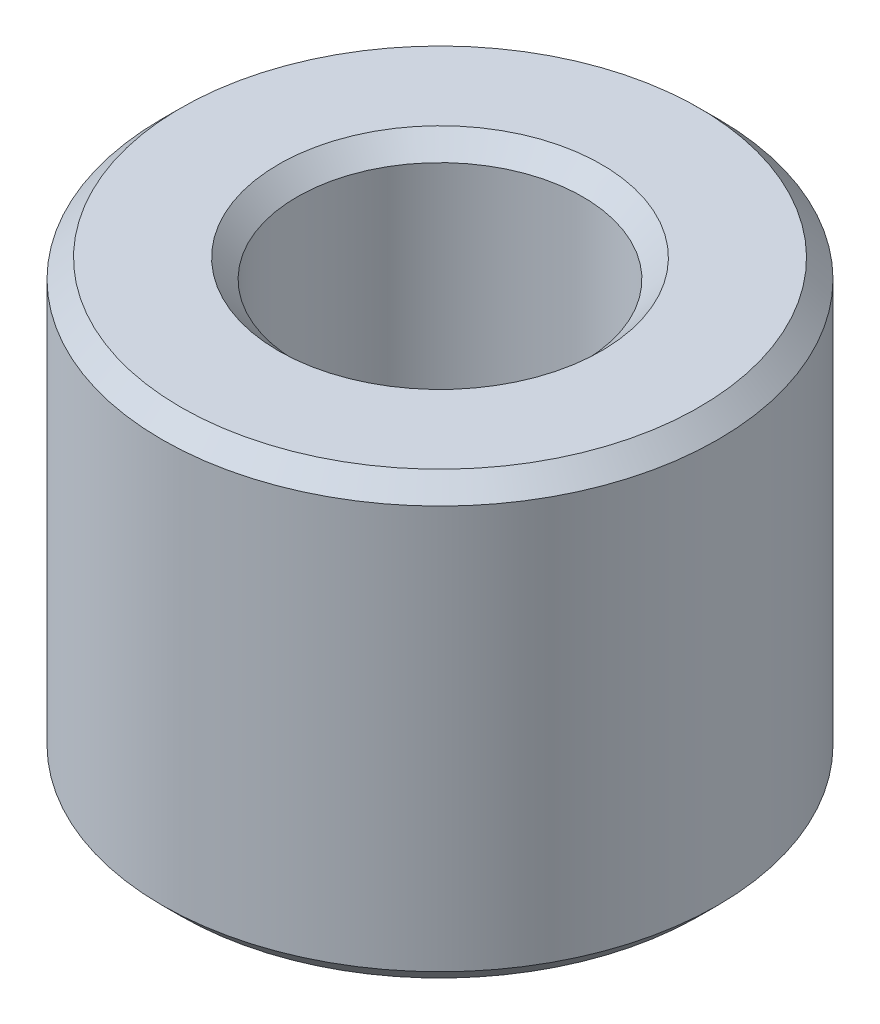
ISO-10303-21;
HEADER;
FILE_DESCRIPTION(('STEP AP214'),'2;1');
FILE_NAME('part.step','',(''),(''),'','','');
FILE_SCHEMA(('AUTOMOTIVE_DESIGN { 1 0 10303 214 1 1 1 1 }'));
ENDSEC;
DATA;
#1=APPLICATION_CONTEXT('core data for automotive mechanical design processes');
#2=APPLICATION_PROTOCOL_DEFINITION('international standard','automotive_design',2000,#1);
#3=PRODUCT_CONTEXT('',#1,'mechanical');
#4=PRODUCT('Part','Part','',(#3));
#5=PRODUCT_RELATED_PRODUCT_CATEGORY('part','',(#4));
#6=PRODUCT_DEFINITION_FORMATION('','',#4);
#7=PRODUCT_DEFINITION_CONTEXT('part definition',#1,'design');
#8=PRODUCT_DEFINITION('design','',#6,#7);
#9=PRODUCT_DEFINITION_SHAPE('','',#8);
#10=(LENGTH_UNIT() NAMED_UNIT(*) SI_UNIT(.MILLI.,.METRE.));
#11=(NAMED_UNIT(*) PLANE_ANGLE_UNIT() SI_UNIT($,.RADIAN.));
#12=(NAMED_UNIT(*) SI_UNIT($,.STERADIAN.) SOLID_ANGLE_UNIT());
#13=UNCERTAINTY_MEASURE_WITH_UNIT(LENGTH_MEASURE(1.E-05),#10,'distance_accuracy_value','');
#14=(GEOMETRIC_REPRESENTATION_CONTEXT(3) GLOBAL_UNCERTAINTY_ASSIGNED_CONTEXT((#13)) GLOBAL_UNIT_ASSIGNED_CONTEXT((#10,
#11,#12)) REPRESENTATION_CONTEXT('',''));
#15=CARTESIAN_POINT('',(0.,0.,0.));
#16=DIRECTION('',(0.,0.,1.));
#17=DIRECTION('',(1.,0.,0.));
#18=AXIS2_PLACEMENT_3D('',#15,#16,#17);
#19=CARTESIAN_POINT('',(0.,51.5385850366765,0.));
#20=DIRECTION('',(0.,-1.,0.));
#21=DIRECTION('',(0.,0.,-1.));
#22=AXIS2_PLACEMENT_3D('',#19,#20,#21);
#23=CYLINDRICAL_SURFACE('',#22,32.5);
#24=CARTESIAN_POINT('',(0.,2.18962252657158,0.));
#25=DIRECTION('',(0.,1.,0.));
#26=DIRECTION('',(0.,0.,1.));
#27=AXIS2_PLACEMENT_3D('',#24,#25,#26);
#28=CIRCLE('',#27,32.5);
#29=CARTESIAN_POINT('',(0.,2.18962252657158,32.5));
#30=VERTEX_POINT('',#29);
#31=EDGE_CURVE('E10',#30,#30,#28,.T.);
#32=ORIENTED_EDGE('',*,*,#31,.T.);
#33=EDGE_LOOP('',(#32));
#34=FACE_BOUND('',#33,.T.);
#35=CARTESIAN_POINT('',(0.,49.3489625101049,0.));
#36=DIRECTION('',(0.,1.,0.));
#37=DIRECTION('',(0.,0.,1.));
#38=AXIS2_PLACEMENT_3D('',#35,#36,#37);
#39=CIRCLE('',#38,32.5);
#40=CARTESIAN_POINT('',(0.,49.3489625101049,32.5));
#41=VERTEX_POINT('',#40);
#42=EDGE_CURVE('E50',#41,#41,#39,.F.);
#43=ORIENTED_EDGE('',*,*,#42,.T.);
#44=EDGE_LOOP('',(#43));
#45=FACE_BOUND('',#44,.T.);
#46=ADVANCED_FACE('F39',(#34,#45),#23,.T.);
#47=CARTESIAN_POINT('',(0.,51.5385850366765,0.));
#48=DIRECTION('',(0.,1.,0.));
#49=DIRECTION('',(0.,0.,1.));
#50=AXIS2_PLACEMENT_3D('',#47,#48,#49);
#51=PLANE('',#50);
#52=CARTESIAN_POINT('',(0.,51.5385850366765,0.));
#53=DIRECTION('',(0.,1.,0.));
#54=DIRECTION('',(0.,0.,1.));
#55=AXIS2_PLACEMENT_3D('',#52,#53,#54);
#56=CIRCLE('',#55,18.8907314554455);
#57=CARTESIAN_POINT('',(0.,51.5385850366765,18.8907314554455));
#58=VERTEX_POINT('',#57);
#59=EDGE_CURVE('E58',#58,#58,#56,.F.);
#60=ORIENTED_EDGE('',*,*,#59,.T.);
#61=EDGE_LOOP('',(#60));
#62=FACE_BOUND('',#61,.T.);
#63=CARTESIAN_POINT('',(0.,51.5385850366765,0.));
#64=DIRECTION('',(0.,1.,0.));
#65=DIRECTION('',(0.,0.,1.));
#66=AXIS2_PLACEMENT_3D('',#63,#64,#65);
#67=CIRCLE('',#66,30.3103774734284);
#68=CARTESIAN_POINT('',(0.,51.5385850366765,30.3103774734284));
#69=VERTEX_POINT('',#68);
#70=EDGE_CURVE('E61',#69,#69,#67,.T.);
#71=ORIENTED_EDGE('',*,*,#70,.T.);
#72=EDGE_LOOP('',(#71));
#73=FACE_BOUND('',#72,.T.);
#74=ADVANCED_FACE('F88',(#62,#73),#51,.T.);
#75=CARTESIAN_POINT('',(0.,0.,0.));
#76=DIRECTION('',(0.,1.,0.));
#77=DIRECTION('',(0.,0.,1.));
#78=AXIS2_PLACEMENT_3D('',#75,#76,#77);
#79=PLANE('',#78);
#80=CARTESIAN_POINT('',(0.,0.,0.));
#81=DIRECTION('',(0.,1.,0.));
#82=DIRECTION('',(0.,0.,1.));
#83=AXIS2_PLACEMENT_3D('',#80,#81,#82);
#84=CIRCLE('',#83,18.8907314554455);
#85=CARTESIAN_POINT('',(0.,0.,18.8907314554455));
#86=VERTEX_POINT('',#85);
#87=EDGE_CURVE('E51',#86,#86,#84,.T.);
#88=ORIENTED_EDGE('',*,*,#87,.T.);
#89=EDGE_LOOP('',(#88));
#90=FACE_BOUND('',#89,.T.);
#91=CARTESIAN_POINT('',(0.,0.,0.));
#92=DIRECTION('',(0.,1.,0.));
#93=DIRECTION('',(0.,0.,1.));
#94=AXIS2_PLACEMENT_3D('',#91,#92,#93);
#95=CIRCLE('',#94,30.3103774734284);
#96=CARTESIAN_POINT('',(0.,0.,30.3103774734284));
#97=VERTEX_POINT('',#96);
#98=EDGE_CURVE('E54',#97,#97,#95,.F.);
#99=ORIENTED_EDGE('',*,*,#98,.T.);
#100=EDGE_LOOP('',(#99));
#101=FACE_BOUND('',#100,.T.);
#102=ADVANCED_FACE('F83',(#90,#101),#79,.F.);
#103=CARTESIAN_POINT('',(0.,51.5385850366765,0.));
#104=DIRECTION('',(0.,-1.,0.));
#105=DIRECTION('',(0.,0.,-1.));
#106=AXIS2_PLACEMENT_3D('',#103,#104,#105);
#107=CYLINDRICAL_SURFACE('',#106,16.701108928874);
#108=CARTESIAN_POINT('',(0.,49.3489625101049,0.));
#109=DIRECTION('',(0.,1.,0.));
#110=DIRECTION('',(0.,0.,1.));
#111=AXIS2_PLACEMENT_3D('',#108,#109,#110);
#112=CIRCLE('',#111,16.701108928874);
#113=CARTESIAN_POINT('',(0.,49.3489625101049,16.701108928874));
#114=VERTEX_POINT('',#113);
#115=EDGE_CURVE('E67',#114,#114,#112,.T.);
#116=ORIENTED_EDGE('',*,*,#115,.T.);
#117=EDGE_LOOP('',(#116));
#118=FACE_BOUND('',#117,.T.);
#119=CARTESIAN_POINT('',(0.,2.18962252657158,0.));
#120=DIRECTION('',(0.,1.,0.));
#121=DIRECTION('',(0.,0.,1.));
#122=AXIS2_PLACEMENT_3D('',#119,#120,#121);
#123=CIRCLE('',#122,16.701108928874);
#124=CARTESIAN_POINT('',(0.,2.18962252657158,16.701108928874));
#125=VERTEX_POINT('',#124);
#126=EDGE_CURVE('E69',#125,#125,#123,.F.);
#127=ORIENTED_EDGE('',*,*,#126,.T.);
#128=EDGE_LOOP('',(#127));
#129=FACE_BOUND('',#128,.T.);
#130=ADVANCED_FACE('F71',(#118,#129),#107,.F.);
#131=CARTESIAN_POINT('',(0.,49.3489625101049,0.));
#132=DIRECTION('',(0.,1.,0.));
#133=DIRECTION('',(0.,0.,1.));
#134=AXIS2_PLACEMENT_3D('',#131,#132,#133);
#135=CONICAL_SURFACE('',#134,16.701108928874,0.785398163397453);
#136=ORIENTED_EDGE('',*,*,#59,.F.);
#137=EDGE_LOOP('',(#136));
#138=FACE_BOUND('',#137,.T.);
#139=ORIENTED_EDGE('',*,*,#115,.F.);
#140=EDGE_LOOP('',(#139));
#141=FACE_BOUND('',#140,.T.);
#142=ADVANCED_FACE('F77',(#138,#141),#135,.F.);
#143=CARTESIAN_POINT('',(0.,0.,0.));
#144=DIRECTION('',(0.,-1.,0.));
#145=DIRECTION('',(0.,0.,-1.));
#146=AXIS2_PLACEMENT_3D('',#143,#144,#145);
#147=CONICAL_SURFACE('',#146,18.8907314554455,0.785398163397445);
#148=ORIENTED_EDGE('',*,*,#126,.F.);
#149=EDGE_LOOP('',(#148));
#150=FACE_BOUND('',#149,.T.);
#151=ORIENTED_EDGE('',*,*,#87,.F.);
#152=EDGE_LOOP('',(#151));
#153=FACE_BOUND('',#152,.T.);
#154=ADVANCED_FACE('F73',(#150,#153),#147,.F.);
#155=CARTESIAN_POINT('',(0.,2.18962252657158,0.));
#156=DIRECTION('',(0.,1.,0.));
#157=DIRECTION('',(0.,0.,1.));
#158=AXIS2_PLACEMENT_3D('',#155,#156,#157);
#159=CONICAL_SURFACE('',#158,32.5,0.785398163397453);
#160=ORIENTED_EDGE('',*,*,#98,.F.);
#161=EDGE_LOOP('',(#160));
#162=FACE_BOUND('',#161,.T.);
#163=ORIENTED_EDGE('',*,*,#31,.F.);
#164=EDGE_LOOP('',(#163));
#165=FACE_BOUND('',#164,.T.);
#166=ADVANCED_FACE('F76',(#162,#165),#159,.T.);
#167=CARTESIAN_POINT('',(0.,51.5385850366765,0.));
#168=DIRECTION('',(0.,-1.,0.));
#169=DIRECTION('',(0.,0.,-1.));
#170=AXIS2_PLACEMENT_3D('',#167,#168,#169);
#171=CONICAL_SURFACE('',#170,30.3103774734284,0.785398163397444);
#172=ORIENTED_EDGE('',*,*,#42,.F.);
#173=EDGE_LOOP('',(#172));
#174=FACE_BOUND('',#173,.T.);
#175=ORIENTED_EDGE('',*,*,#70,.F.);
#176=EDGE_LOOP('',(#175));
#177=FACE_BOUND('',#176,.T.);
#178=ADVANCED_FACE('F45',(#174,#177),#171,.T.);
#179=CLOSED_SHELL('',(#46,#74,#102,#130,#142,#154,#166,#178));
#180=MANIFOLD_SOLID_BREP('B2',#179);
#181=ADVANCED_BREP_SHAPE_REPRESENTATION('',(#18,#180),#14);
#182=SHAPE_DEFINITION_REPRESENTATION(#9,#181);
ENDSEC;
END-ISO-10303-21;
